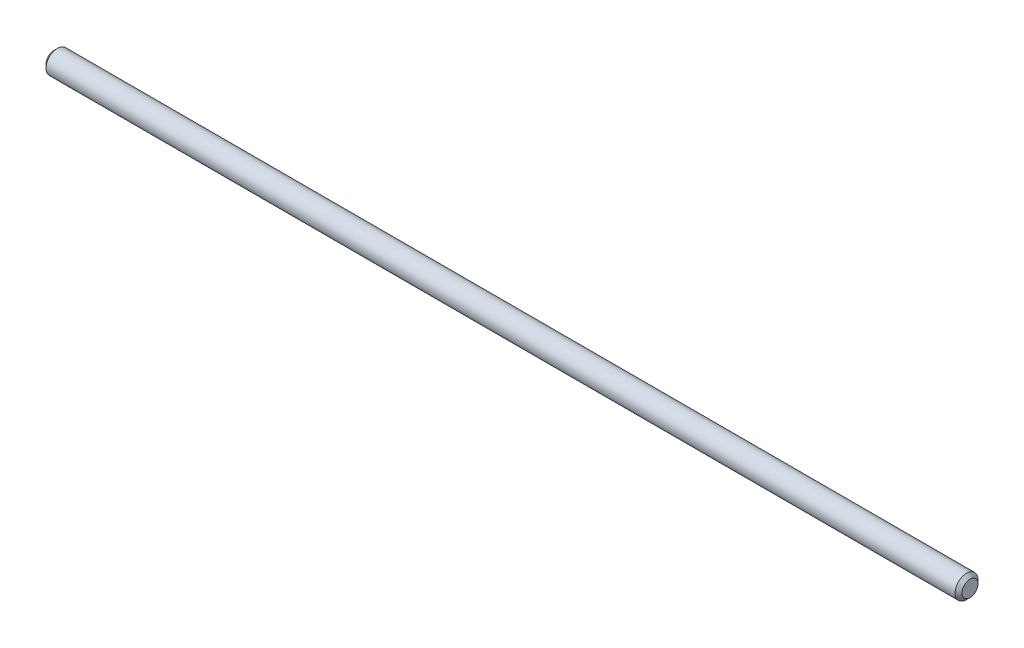
ISO-10303-21;
HEADER;
FILE_DESCRIPTION(('STEP AP214'),'2;1');
FILE_NAME('part.step','',(''),(''),'','','');
FILE_SCHEMA(('AUTOMOTIVE_DESIGN { 1 0 10303 214 1 1 1 1 }'));
ENDSEC;
DATA;
#1=APPLICATION_CONTEXT('core data for automotive mechanical design processes');
#2=APPLICATION_PROTOCOL_DEFINITION('international standard','automotive_design',2000,#1);
#3=PRODUCT_CONTEXT('',#1,'mechanical');
#4=PRODUCT('Part','Part','',(#3));
#5=PRODUCT_RELATED_PRODUCT_CATEGORY('part','',(#4));
#6=PRODUCT_DEFINITION_FORMATION('','',#4);
#7=PRODUCT_DEFINITION_CONTEXT('part definition',#1,'design');
#8=PRODUCT_DEFINITION('design','',#6,#7);
#9=PRODUCT_DEFINITION_SHAPE('','',#8);
#10=(LENGTH_UNIT() NAMED_UNIT(*) SI_UNIT(.MILLI.,.METRE.));
#11=(NAMED_UNIT(*) PLANE_ANGLE_UNIT() SI_UNIT($,.RADIAN.));
#12=(NAMED_UNIT(*) SI_UNIT($,.STERADIAN.) SOLID_ANGLE_UNIT());
#13=UNCERTAINTY_MEASURE_WITH_UNIT(LENGTH_MEASURE(1.E-05),#10,'distance_accuracy_value','');
#14=(GEOMETRIC_REPRESENTATION_CONTEXT(3) GLOBAL_UNCERTAINTY_ASSIGNED_CONTEXT((#13)) GLOBAL_UNIT_ASSIGNED_CONTEXT((#10,
#11,#12)) REPRESENTATION_CONTEXT('',''));
#15=CARTESIAN_POINT('',(0.,0.,0.));
#16=DIRECTION('',(0.,0.,1.));
#17=DIRECTION('',(1.,0.,0.));
#18=AXIS2_PLACEMENT_3D('',#15,#16,#17);
#19=CARTESIAN_POINT('',(0.,0.,0.));
#20=DIRECTION('',(1.,0.,0.));
#21=DIRECTION('',(0.,0.,-1.));
#22=AXIS2_PLACEMENT_3D('',#19,#20,#21);
#23=PLANE('',#22);
#24=CARTESIAN_POINT('',(0.,0.,0.));
#25=DIRECTION('',(1.,0.,0.));
#26=DIRECTION('',(0.,0.,-1.));
#27=AXIS2_PLACEMENT_3D('',#24,#25,#26);
#28=CIRCLE('',#27,7.00000000000001);
#29=CARTESIAN_POINT('',(0.,0.,-7.00000000000001));
#30=VERTEX_POINT('',#29);
#31=EDGE_CURVE('E10',#30,#30,#28,.F.);
#32=ORIENTED_EDGE('',*,*,#31,.T.);
#33=EDGE_LOOP('',(#32));
#34=FACE_BOUND('',#33,.T.);
#35=ADVANCED_FACE('F32',(#34),#23,.F.);
#36=CARTESIAN_POINT('',(-457.135147173933,0.,0.));
#37=DIRECTION('',(-1.,0.,0.));
#38=DIRECTION('',(0.,0.,1.));
#39=AXIS2_PLACEMENT_3D('',#36,#37,#38);
#40=CYLINDRICAL_SURFACE('',#39,9.99999999999999);
#41=CARTESIAN_POINT('',(797.,0.,0.));
#42=DIRECTION('',(-1.,0.,0.));
#43=DIRECTION('',(0.,0.,1.));
#44=AXIS2_PLACEMENT_3D('',#41,#42,#43);
#45=CIRCLE('',#44,9.99999999999999);
#46=CARTESIAN_POINT('',(797.,0.,9.99999999999999));
#47=VERTEX_POINT('',#46);
#48=EDGE_CURVE('E44',#47,#47,#45,.T.);
#49=ORIENTED_EDGE('',*,*,#48,.T.);
#50=EDGE_LOOP('',(#49));
#51=FACE_BOUND('',#50,.T.);
#52=CARTESIAN_POINT('',(3.,0.,0.));
#53=DIRECTION('',(1.,0.,0.));
#54=DIRECTION('',(0.,0.,-1.));
#55=AXIS2_PLACEMENT_3D('',#52,#53,#54);
#56=CIRCLE('',#55,9.99999999999999);
#57=CARTESIAN_POINT('',(3.,0.,-9.99999999999999));
#58=VERTEX_POINT('',#57);
#59=EDGE_CURVE('E48',#58,#58,#56,.T.);
#60=ORIENTED_EDGE('',*,*,#59,.T.);
#61=EDGE_LOOP('',(#60));
#62=FACE_BOUND('',#61,.T.);
#63=ADVANCED_FACE('F54',(#51,#62),#40,.T.);
#64=CARTESIAN_POINT('',(800.,9.99999999999999,0.));
#65=DIRECTION('',(-1.,0.,0.));
#66=DIRECTION('',(0.,0.,1.));
#67=AXIS2_PLACEMENT_3D('',#64,#65,#66);
#68=PLANE('',#67);
#69=CARTESIAN_POINT('',(800.,0.,0.));
#70=DIRECTION('',(-1.,0.,0.));
#71=DIRECTION('',(0.,0.,1.));
#72=AXIS2_PLACEMENT_3D('',#69,#70,#71);
#73=CIRCLE('',#72,6.9999999999999);
#74=CARTESIAN_POINT('',(800.,0.,6.9999999999999));
#75=VERTEX_POINT('',#74);
#76=EDGE_CURVE('E40',#75,#75,#73,.F.);
#77=ORIENTED_EDGE('',*,*,#76,.T.);
#78=EDGE_LOOP('',(#77));
#79=FACE_BOUND('',#78,.T.);
#80=ADVANCED_FACE('F62',(#79),#68,.F.);
#81=CARTESIAN_POINT('',(797.,0.,0.));
#82=DIRECTION('',(-1.,0.,0.));
#83=DIRECTION('',(0.,0.,1.));
#84=AXIS2_PLACEMENT_3D('',#81,#82,#83);
#85=CONICAL_SURFACE('',#84,9.99999999999999,0.785398163397409);
#86=ORIENTED_EDGE('',*,*,#76,.F.);
#87=EDGE_LOOP('',(#86));
#88=FACE_BOUND('',#87,.T.);
#89=ORIENTED_EDGE('',*,*,#48,.F.);
#90=EDGE_LOOP('',(#89));
#91=FACE_BOUND('',#90,.T.);
#92=ADVANCED_FACE('F58',(#88,#91),#85,.T.);
#93=CARTESIAN_POINT('',(0.,0.,0.));
#94=DIRECTION('',(1.,0.,0.));
#95=DIRECTION('',(0.,0.,-1.));
#96=AXIS2_PLACEMENT_3D('',#93,#94,#95);
#97=CONICAL_SURFACE('',#96,7.00000000000001,0.785398163397446);
#98=ORIENTED_EDGE('',*,*,#59,.F.);
#99=EDGE_LOOP('',(#98));
#100=FACE_BOUND('',#99,.T.);
#101=ORIENTED_EDGE('',*,*,#31,.F.);
#102=EDGE_LOOP('',(#101));
#103=FACE_BOUND('',#102,.T.);
#104=ADVANCED_FACE('F35',(#100,#103),#97,.T.);
#105=CLOSED_SHELL('',(#35,#63,#80,#92,#104));
#106=MANIFOLD_SOLID_BREP('B2',#105);
#107=ADVANCED_BREP_SHAPE_REPRESENTATION('',(#18,#106),#14);
#108=SHAPE_DEFINITION_REPRESENTATION(#9,#107);
ENDSEC;
END-ISO-10303-21;
